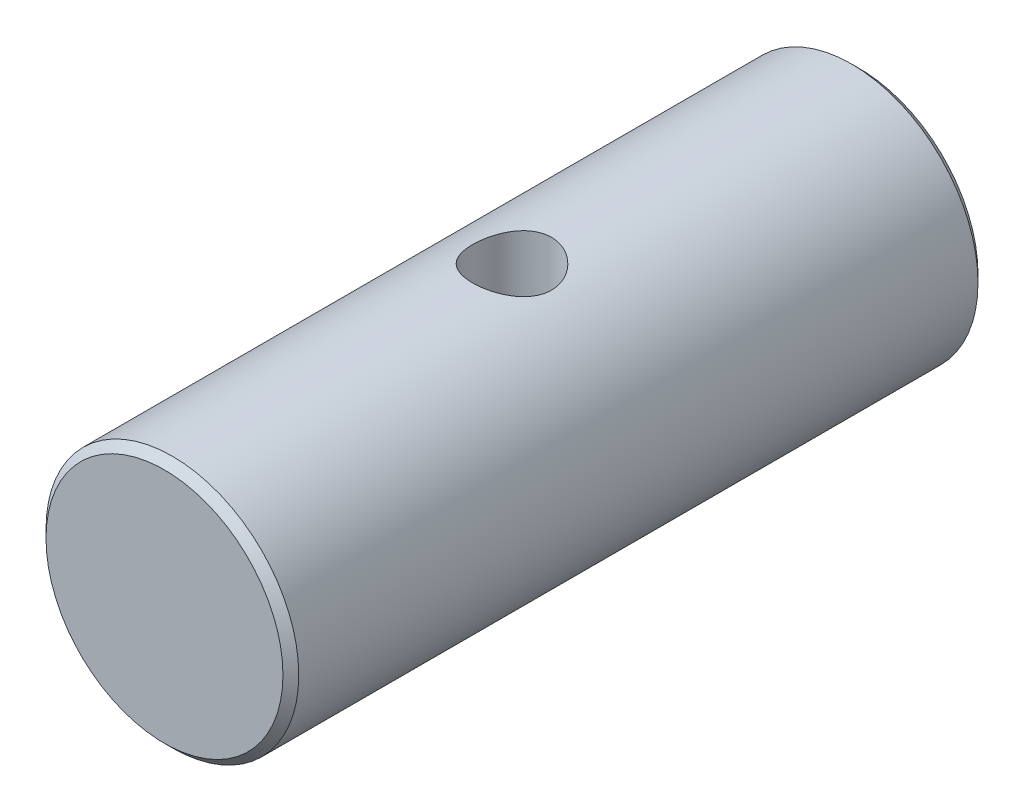
ISO-10303-21;
HEADER;
FILE_DESCRIPTION(('STEP AP214'),'2;1');
FILE_NAME('part.step','',(''),(''),'','','');
FILE_SCHEMA(('AUTOMOTIVE_DESIGN { 1 0 10303 214 1 1 1 1 }'));
ENDSEC;
DATA;
#1=APPLICATION_CONTEXT('core data for automotive mechanical design processes');
#2=APPLICATION_PROTOCOL_DEFINITION('international standard','automotive_design',2000,#1);
#3=PRODUCT_CONTEXT('',#1,'mechanical');
#4=PRODUCT('Part','Part','',(#3));
#5=PRODUCT_RELATED_PRODUCT_CATEGORY('part','',(#4));
#6=PRODUCT_DEFINITION_FORMATION('','',#4);
#7=PRODUCT_DEFINITION_CONTEXT('part definition',#1,'design');
#8=PRODUCT_DEFINITION('design','',#6,#7);
#9=PRODUCT_DEFINITION_SHAPE('','',#8);
#10=(LENGTH_UNIT() NAMED_UNIT(*) SI_UNIT(.MILLI.,.METRE.));
#11=(NAMED_UNIT(*) PLANE_ANGLE_UNIT() SI_UNIT($,.RADIAN.));
#12=(NAMED_UNIT(*) SI_UNIT($,.STERADIAN.) SOLID_ANGLE_UNIT());
#13=UNCERTAINTY_MEASURE_WITH_UNIT(LENGTH_MEASURE(1.E-05),#10,'distance_accuracy_value','');
#14=(GEOMETRIC_REPRESENTATION_CONTEXT(3) GLOBAL_UNCERTAINTY_ASSIGNED_CONTEXT((#13)) GLOBAL_UNIT_ASSIGNED_CONTEXT((#10,
#11,#12)) REPRESENTATION_CONTEXT('',''));
#15=CARTESIAN_POINT('',(0.,0.,0.));
#16=DIRECTION('',(0.,0.,1.));
#17=DIRECTION('',(1.,0.,0.));
#18=AXIS2_PLACEMENT_3D('',#15,#16,#17);
#19=CARTESIAN_POINT('',(0.,0.,44.));
#20=DIRECTION('',(0.,0.,-1.));
#21=DIRECTION('',(-1.,0.,0.));
#22=AXIS2_PLACEMENT_3D('',#19,#20,#21);
#23=CYLINDRICAL_SURFACE('',#22,8.);
#24=CARTESIAN_POINT('',(0.,0.,0.5));
#25=DIRECTION('',(0.,0.,1.));
#26=DIRECTION('',(1.,0.,0.));
#27=AXIS2_PLACEMENT_3D('',#24,#25,#26);
#28=CIRCLE('',#27,8.);
#29=CARTESIAN_POINT('',(8.,0.,0.5));
#30=VERTEX_POINT('',#29);
#31=EDGE_CURVE('E48',#30,#30,#28,.T.);
#32=ORIENTED_EDGE('',*,*,#31,.T.);
#33=EDGE_LOOP('',(#32));
#34=FACE_BOUND('',#33,.T.);
#35=CARTESIAN_POINT('',(0.,0.,43.5));
#36=DIRECTION('',(0.,0.,1.));
#37=DIRECTION('',(1.,0.,0.));
#38=AXIS2_PLACEMENT_3D('',#35,#36,#37);
#39=CIRCLE('',#38,8.);
#40=CARTESIAN_POINT('',(8.,0.,43.5));
#41=VERTEX_POINT('',#40);
#42=EDGE_CURVE('E52',#41,#41,#39,.F.);
#43=ORIENTED_EDGE('',*,*,#42,.T.);
#44=EDGE_LOOP('',(#43));
#45=FACE_BOUND('',#44,.T.);
#46=CARTESIAN_POINT('',(0.,-8.,24.5));
#47=CARTESIAN_POINT('',(0.136878370349093,-7.9999993175598,24.4999991068248));
#48=CARTESIAN_POINT('',(0.273766105005718,-7.99645389969682,24.4887215461111));
#49=CARTESIAN_POINT('',(0.543538419176896,-7.98265788177613,24.4440275169215));
#50=CARTESIAN_POINT('',(0.676422085451815,-7.97240576399719,24.4106060372713));
#51=CARTESIAN_POINT('',(0.934257087301613,-7.94631631395819,24.3228612576085));
#52=CARTESIAN_POINT('',(1.05922035397161,-7.9304876299805,24.2685703106941));
#53=CARTESIAN_POINT('',(1.29826960469292,-7.89487938322185,24.1407653646433));
#54=CARTESIAN_POINT('',(1.41235387088977,-7.8750991979981,24.0672483364388));
#55=CARTESIAN_POINT('',(1.62993066990456,-7.83300427480565,23.9006880159653));
#56=CARTESIAN_POINT('',(1.73304005631332,-7.81063431853978,23.8071582298779));
#57=CARTESIAN_POINT('',(1.92239476407399,-7.76620092748417,23.6042632151729));
#58=CARTESIAN_POINT('',(2.00863694579739,-7.74413755046914,23.4948950450109));
#59=CARTESIAN_POINT('',(2.16388672966227,-7.70222289396344,23.2601108723838));
#60=CARTESIAN_POINT('',(2.23241568300257,-7.68243976603591,23.1343650449456));
#61=CARTESIAN_POINT('',(2.34719482153343,-7.64815603598468,22.8724153700363));
#62=CARTESIAN_POINT('',(2.39345087543889,-7.63365404257377,22.7362142884121));
#63=CARTESIAN_POINT('',(2.46096919860067,-7.61215213969001,22.4615438450959));
#64=CARTESIAN_POINT('',(2.48294220015729,-7.60493945859016,22.3232663127223));
#65=CARTESIAN_POINT('',(2.50349110073976,-7.59820110281901,22.0448137621762));
#66=CARTESIAN_POINT('',(2.50207321991544,-7.59867338454669,21.9046392583567));
#67=CARTESIAN_POINT('',(2.47643649465478,-7.60706378150876,21.632251079462));
#68=CARTESIAN_POINT('',(2.45312115738766,-7.61468683491897,21.4999417482769));
#69=CARTESIAN_POINT('',(2.38581626711252,-7.63604051304978,21.2412156869253));
#70=CARTESIAN_POINT('',(2.34182451689101,-7.64977178686229,21.1147995845824));
#71=CARTESIAN_POINT('',(2.23377749362555,-7.68202088028593,20.8692961111347));
#72=CARTESIAN_POINT('',(2.16943851324164,-7.70060569321649,20.750342778616));
#73=CARTESIAN_POINT('',(2.02272041475696,-7.7404371316014,20.5246244642418));
#74=CARTESIAN_POINT('',(1.94033661043155,-7.76168444789102,20.4178626594926));
#75=CARTESIAN_POINT('',(1.75543390836425,-7.80563055600986,20.214450113166));
#76=CARTESIAN_POINT('',(1.65216914118564,-7.82835139211391,20.1184808844406));
#77=CARTESIAN_POINT('',(1.43072881619106,-7.8718314151916,19.9450562128406));
#78=CARTESIAN_POINT('',(1.31255215469804,-7.89259045676745,19.8676021415616));
#79=CARTESIAN_POINT('',(1.06332922093091,-7.93002589780382,19.7329446227974));
#80=CARTESIAN_POINT('',(0.932189813838559,-7.94666921296415,19.6759037290721));
#81=CARTESIAN_POINT('',(0.661535955565289,-7.97375911657108,19.5848939982969));
#82=CARTESIAN_POINT('',(0.522024061449218,-7.98420758650304,19.5509181555232));
#83=CARTESIAN_POINT('',(0.244370314580691,-7.99742778790027,19.508163914842));
#84=CARTESIAN_POINT('',(0.106383697577687,-8.00048045790873,19.4984629128129));
#85=CARTESIAN_POINT('',(-0.169260611465171,-7.99939599461967,19.5019324532747));
#86=CARTESIAN_POINT('',(-0.306918348613017,-7.9952599116227,19.5150996546452));
#87=CARTESIAN_POINT('',(-0.574438665951697,-7.98044727539523,19.5631911852128));
#88=CARTESIAN_POINT('',(-0.704409956841872,-7.96993586221374,19.597566535225));
#89=CARTESIAN_POINT('',(-0.956703857722753,-7.94360242758579,19.6864287047334));
#90=CARTESIAN_POINT('',(-1.07902552089812,-7.92777975028687,19.74091800805));
#91=CARTESIAN_POINT('',(-1.31586481334438,-7.89197085518848,19.8699464330974));
#92=CARTESIAN_POINT('',(-1.43011947957558,-7.87189253635335,19.9449419749936));
#93=CARTESIAN_POINT('',(-1.64473170192052,-7.82986820006859,20.1123064202349));
#94=CARTESIAN_POINT('',(-1.7450854760879,-7.80792167695774,20.2046800354893));
#95=CARTESIAN_POINT('',(-1.93317492583804,-7.76353989766283,20.4085177801042));
#96=CARTESIAN_POINT('',(-2.02025304679062,-7.74111973412883,20.5205933274784));
#97=CARTESIAN_POINT('',(-2.17442500490303,-7.69923894191212,20.7582532327535));
#98=CARTESIAN_POINT('',(-2.24151915946859,-7.67977826622621,20.883837376054));
#99=CARTESIAN_POINT('',(-2.35340166961084,-7.64623564661738,21.144690345741));
#100=CARTESIAN_POINT('',(-2.39827639112025,-7.63213292713749,21.2799192988714));
#101=CARTESIAN_POINT('',(-2.4644578863618,-7.6110234168862,21.5565449864972));
#102=CARTESIAN_POINT('',(-2.48577362827989,-7.60401392602456,21.6979393526871));
#103=CARTESIAN_POINT('',(-2.50358812316251,-7.59816585427753,21.9760081751609));
#104=CARTESIAN_POINT('',(-2.50116559243271,-7.59897209200284,22.1126069076948));
#105=CARTESIAN_POINT('',(-2.47417636257668,-7.60780180751807,22.3833491698839));
#106=CARTESIAN_POINT('',(-2.44961069645024,-7.61582494863208,22.5174928137735));
#107=CARTESIAN_POINT('',(-2.37975459827235,-7.6379362836678,22.7775880791838));
#108=CARTESIAN_POINT('',(-2.33477284812017,-7.65193396380514,22.9036308821867));
#109=CARTESIAN_POINT('',(-2.22560454669999,-7.68439408509128,23.146480827068));
#110=CARTESIAN_POINT('',(-2.16141408888474,-7.70285743429343,23.2632860841568));
#111=CARTESIAN_POINT('',(-2.01271350026987,-7.74306974067005,23.4892919408796));
#112=CARTESIAN_POINT('',(-1.92750667048265,-7.76491897845913,23.5980162590005));
#113=CARTESIAN_POINT('',(-1.7404179928096,-7.8089799764242,23.799972656224));
#114=CARTESIAN_POINT('',(-1.63853168468878,-7.83119183213309,23.8932005779821));
#115=CARTESIAN_POINT('',(-1.41697332564669,-7.87434543904947,24.0645650767259));
#116=CARTESIAN_POINT('',(-1.29682914897477,-7.89522203461346,24.1421094728999));
#117=CARTESIAN_POINT('',(-1.0445582760273,-7.93253538593756,24.2757978302789));
#118=CARTESIAN_POINT('',(-0.912436315590897,-7.94897388631644,24.3319502042837));
#119=CARTESIAN_POINT('',(-0.651495270747958,-7.97441301466941,24.4171827352169));
#120=CARTESIAN_POINT('',(-0.523340674225093,-7.98392481612283,24.4481497346107));
#121=CARTESIAN_POINT('',(-0.263459790880495,-7.99671800680967,24.4895567199354));
#122=CARTESIAN_POINT('',(-0.13173423227935,-8.00000065679286,24.500000859608));
#123=CARTESIAN_POINT('',(0.,-8.,24.5));
#124=B_SPLINE_CURVE_WITH_KNOTS('',3,(#46,#47,#48,#49,#50,#51,#52,#53,#54,#55,#56,#57,#58,#59,
#60,#61,#62,#63,#64,#65,#66,#67,#68,#69,#70,#71,#72,#73,#74,#75,#76,#77,#78,#79,#80,#81,#82,#83,
#84,#85,#86,#87,#88,#89,#90,#91,#92,#93,#94,#95,#96,#97,#98,#99,#100,#101,#102,#103,#104,#105,
#106,#107,#108,#109,#110,#111,#112,#113,#114,#115,#116,#117,#118,#119,#120,#121,#122,#123),
.UNSPECIFIED.,.T.,.F.,(4,2,2,2,2,2,2,2,2,2,2,2,2,2,2,2,2,2,2,2,2,2,2,2,2,2,2,2,2,2,2,2,2,2,2,2,
2,2,4),(0.,0.41015089886502,0.820394646698132,1.23000495840487,1.63967984311678,
2.06075644390316,2.48191134862552,2.91347542494988,3.34492572559054,3.76338300334419,
4.18172900590276,4.58353834844338,4.98539039958125,5.3931128544109,5.80094132020716,
6.227334945592,6.65376014826606,7.0835092137954,7.51312768989108,7.92615137096475,
8.33911471298725,8.74181253445744,9.14456010068999,9.55712649476687,9.96980491418518,
10.3988355742628,10.8278594196742,11.2552023150671,11.6823824779468,12.0902440696666,
12.4980866352126,12.8999582681244,13.3019116867944,13.7195902803182,14.1373807476578,
14.5688133627192,15.0000761335177,15.3948927332218,15.7896294154519),.UNSPECIFIED.);
#125=CARTESIAN_POINT('',(0.,-8.,24.5));
#126=VERTEX_POINT('',#125);
#127=EDGE_CURVE('E57',#126,#126,#124,.T.);
#128=ORIENTED_EDGE('',*,*,#127,.T.);
#129=EDGE_LOOP('',(#128));
#130=FACE_BOUND('',#129,.T.);
#131=CARTESIAN_POINT('',(0.,8.,24.5));
#132=CARTESIAN_POINT('',(-0.136878370349093,7.9999993175598,24.4999991068248));
#133=CARTESIAN_POINT('',(-0.273766105005718,7.99645389969682,24.4887215461111));
#134=CARTESIAN_POINT('',(-0.543538419176896,7.98265788177613,24.4440275169215));
#135=CARTESIAN_POINT('',(-0.676422085451815,7.97240576399719,24.4106060372713));
#136=CARTESIAN_POINT('',(-0.934257087301613,7.94631631395819,24.3228612576085));
#137=CARTESIAN_POINT('',(-1.05922035397161,7.9304876299805,24.2685703106941));
#138=CARTESIAN_POINT('',(-1.29826960469292,7.89487938322185,24.1407653646433));
#139=CARTESIAN_POINT('',(-1.41235387088977,7.8750991979981,24.0672483364388));
#140=CARTESIAN_POINT('',(-1.62993066990456,7.83300427480565,23.9006880159653));
#141=CARTESIAN_POINT('',(-1.73304005631332,7.81063431853978,23.8071582298779));
#142=CARTESIAN_POINT('',(-1.92239476407399,7.76620092748417,23.6042632151729));
#143=CARTESIAN_POINT('',(-2.00863694579739,7.74413755046914,23.4948950450109));
#144=CARTESIAN_POINT('',(-2.16388672966227,7.70222289396344,23.2601108723838));
#145=CARTESIAN_POINT('',(-2.23241568300257,7.68243976603591,23.1343650449456));
#146=CARTESIAN_POINT('',(-2.34719482153343,7.64815603598468,22.8724153700363));
#147=CARTESIAN_POINT('',(-2.39345087543889,7.63365404257377,22.7362142884121));
#148=CARTESIAN_POINT('',(-2.46096919860067,7.61215213969001,22.4615438450959));
#149=CARTESIAN_POINT('',(-2.48294220015729,7.60493945859016,22.3232663127223));
#150=CARTESIAN_POINT('',(-2.50349110073976,7.59820110281901,22.0448137621762));
#151=CARTESIAN_POINT('',(-2.50207321991544,7.59867338454669,21.9046392583567));
#152=CARTESIAN_POINT('',(-2.47643649465478,7.60706378150876,21.632251079462));
#153=CARTESIAN_POINT('',(-2.45312115738766,7.61468683491897,21.4999417482769));
#154=CARTESIAN_POINT('',(-2.38581626711252,7.63604051304978,21.2412156869253));
#155=CARTESIAN_POINT('',(-2.34182451689101,7.64977178686229,21.1147995845824));
#156=CARTESIAN_POINT('',(-2.23377749362555,7.68202088028593,20.8692961111347));
#157=CARTESIAN_POINT('',(-2.16943851324164,7.70060569321649,20.750342778616));
#158=CARTESIAN_POINT('',(-2.02272041475696,7.7404371316014,20.5246244642418));
#159=CARTESIAN_POINT('',(-1.94033661043155,7.76168444789102,20.4178626594926));
#160=CARTESIAN_POINT('',(-1.75543390836425,7.80563055600986,20.214450113166));
#161=CARTESIAN_POINT('',(-1.65216914118564,7.82835139211391,20.1184808844406));
#162=CARTESIAN_POINT('',(-1.43072881619106,7.8718314151916,19.9450562128406));
#163=CARTESIAN_POINT('',(-1.31255215469804,7.89259045676745,19.8676021415616));
#164=CARTESIAN_POINT('',(-1.06332922093091,7.93002589780382,19.7329446227974));
#165=CARTESIAN_POINT('',(-0.932189813838559,7.94666921296415,19.6759037290721));
#166=CARTESIAN_POINT('',(-0.661535955565289,7.97375911657108,19.5848939982969));
#167=CARTESIAN_POINT('',(-0.522024061449218,7.98420758650304,19.5509181555232));
#168=CARTESIAN_POINT('',(-0.244370314580691,7.99742778790027,19.508163914842));
#169=CARTESIAN_POINT('',(-0.106383697577687,8.00048045790873,19.4984629128129));
#170=CARTESIAN_POINT('',(0.169260611465171,7.99939599461967,19.5019324532747));
#171=CARTESIAN_POINT('',(0.306918348613017,7.9952599116227,19.5150996546452));
#172=CARTESIAN_POINT('',(0.574438665951697,7.98044727539523,19.5631911852128));
#173=CARTESIAN_POINT('',(0.704409956841872,7.96993586221374,19.597566535225));
#174=CARTESIAN_POINT('',(0.956703857722753,7.94360242758579,19.6864287047334));
#175=CARTESIAN_POINT('',(1.07902552089812,7.92777975028687,19.74091800805));
#176=CARTESIAN_POINT('',(1.31586481334438,7.89197085518848,19.8699464330974));
#177=CARTESIAN_POINT('',(1.43011947957558,7.87189253635335,19.9449419749936));
#178=CARTESIAN_POINT('',(1.64473170192052,7.82986820006859,20.1123064202349));
#179=CARTESIAN_POINT('',(1.7450854760879,7.80792167695774,20.2046800354893));
#180=CARTESIAN_POINT('',(1.93317492583804,7.76353989766283,20.4085177801042));
#181=CARTESIAN_POINT('',(2.02025304679062,7.74111973412883,20.5205933274784));
#182=CARTESIAN_POINT('',(2.17442500490303,7.69923894191212,20.7582532327535));
#183=CARTESIAN_POINT('',(2.24151915946859,7.67977826622621,20.883837376054));
#184=CARTESIAN_POINT('',(2.35340166961084,7.64623564661738,21.144690345741));
#185=CARTESIAN_POINT('',(2.39827639112025,7.63213292713749,21.2799192988714));
#186=CARTESIAN_POINT('',(2.4644578863618,7.6110234168862,21.5565449864972));
#187=CARTESIAN_POINT('',(2.48577362827989,7.60401392602456,21.6979393526871));
#188=CARTESIAN_POINT('',(2.50358812316251,7.59816585427753,21.9760081751609));
#189=CARTESIAN_POINT('',(2.50116559243271,7.59897209200284,22.1126069076948));
#190=CARTESIAN_POINT('',(2.47417636257668,7.60780180751807,22.3833491698839));
#191=CARTESIAN_POINT('',(2.44961069645024,7.61582494863208,22.5174928137735));
#192=CARTESIAN_POINT('',(2.37975459827235,7.6379362836678,22.7775880791838));
#193=CARTESIAN_POINT('',(2.33477284812017,7.65193396380514,22.9036308821867));
#194=CARTESIAN_POINT('',(2.22560454669999,7.68439408509128,23.146480827068));
#195=CARTESIAN_POINT('',(2.16141408888474,7.70285743429343,23.2632860841568));
#196=CARTESIAN_POINT('',(2.01271350026987,7.74306974067005,23.4892919408796));
#197=CARTESIAN_POINT('',(1.92750667048265,7.76491897845913,23.5980162590005));
#198=CARTESIAN_POINT('',(1.7404179928096,7.8089799764242,23.799972656224));
#199=CARTESIAN_POINT('',(1.63853168468878,7.83119183213309,23.8932005779821));
#200=CARTESIAN_POINT('',(1.41697332564669,7.87434543904947,24.0645650767259));
#201=CARTESIAN_POINT('',(1.29682914897477,7.89522203461346,24.1421094728999));
#202=CARTESIAN_POINT('',(1.0445582760273,7.93253538593756,24.2757978302789));
#203=CARTESIAN_POINT('',(0.912436315590897,7.94897388631644,24.3319502042837));
#204=CARTESIAN_POINT('',(0.651495270747958,7.97441301466941,24.4171827352169));
#205=CARTESIAN_POINT('',(0.523340674225093,7.98392481612283,24.4481497346107));
#206=CARTESIAN_POINT('',(0.263459790880495,7.99671800680967,24.4895567199354));
#207=CARTESIAN_POINT('',(0.13173423227935,8.00000065679286,24.500000859608));
#208=CARTESIAN_POINT('',(0.,8.,24.5));
#209=B_SPLINE_CURVE_WITH_KNOTS('',3,(#131,#132,#133,#134,#135,#136,#137,#138,#139,#140,#141,
#142,#143,#144,#145,#146,#147,#148,#149,#150,#151,#152,#153,#154,#155,#156,#157,#158,#159,#160,
#161,#162,#163,#164,#165,#166,#167,#168,#169,#170,#171,#172,#173,#174,#175,#176,#177,#178,#179,
#180,#181,#182,#183,#184,#185,#186,#187,#188,#189,#190,#191,#192,#193,#194,#195,#196,#197,#198,
#199,#200,#201,#202,#203,#204,#205,#206,#207,#208),.UNSPECIFIED.,.T.,.F.,(4,2,2,2,2,2,2,2,2,2,2,
2,2,2,2,2,2,2,2,2,2,2,2,2,2,2,2,2,2,2,2,2,2,2,2,2,2,2,4),(0.,0.41015089886502,0.820394646698132,
1.23000495840487,1.63967984311678,2.06075644390316,2.48191134862552,2.91347542494988,
3.34492572559054,3.76338300334419,4.18172900590276,4.58353834844338,4.98539039958125,
5.3931128544109,5.80094132020716,6.227334945592,6.65376014826606,7.0835092137954,
7.51312768989108,7.92615137096475,8.33911471298725,8.74181253445744,9.14456010068999,
9.55712649476687,9.96980491418518,10.3988355742628,10.8278594196742,11.2552023150671,
11.6823824779468,12.0902440696666,12.4980866352126,12.8999582681244,13.3019116867944,
13.7195902803182,14.1373807476578,14.5688133627192,15.0000761335177,15.3948927332218,
15.7896294154519),.UNSPECIFIED.);
#210=CARTESIAN_POINT('',(0.,8.,24.5));
#211=VERTEX_POINT('',#210);
#212=EDGE_CURVE('E65',#211,#211,#209,.T.);
#213=ORIENTED_EDGE('',*,*,#212,.T.);
#214=EDGE_LOOP('',(#213));
#215=FACE_BOUND('',#214,.T.);
#216=ADVANCED_FACE('F36',(#34,#45,#130,#215),#23,.T.);
#217=CARTESIAN_POINT('',(0.,0.,44.));
#218=DIRECTION('',(0.,0.,1.));
#219=DIRECTION('',(1.,0.,0.));
#220=AXIS2_PLACEMENT_3D('',#217,#218,#219);
#221=PLANE('',#220);
#222=CARTESIAN_POINT('',(0.,0.,44.));
#223=DIRECTION('',(0.,0.,1.));
#224=DIRECTION('',(1.,0.,0.));
#225=AXIS2_PLACEMENT_3D('',#222,#223,#224);
#226=CIRCLE('',#225,7.5);
#227=CARTESIAN_POINT('',(7.5,0.,44.));
#228=VERTEX_POINT('',#227);
#229=EDGE_CURVE('E10',#228,#228,#226,.T.);
#230=ORIENTED_EDGE('',*,*,#229,.T.);
#231=EDGE_LOOP('',(#230));
#232=FACE_BOUND('',#231,.T.);
#233=ADVANCED_FACE('F78',(#232),#221,.T.);
#234=CARTESIAN_POINT('',(0.,0.,0.));
#235=DIRECTION('',(0.,0.,1.));
#236=DIRECTION('',(1.,0.,0.));
#237=AXIS2_PLACEMENT_3D('',#234,#235,#236);
#238=PLANE('',#237);
#239=CARTESIAN_POINT('',(0.,0.,0.));
#240=DIRECTION('',(0.,0.,1.));
#241=DIRECTION('',(1.,0.,0.));
#242=AXIS2_PLACEMENT_3D('',#239,#240,#241);
#243=CIRCLE('',#242,7.49999999999999);
#244=CARTESIAN_POINT('',(7.49999999999999,0.,0.));
#245=VERTEX_POINT('',#244);
#246=EDGE_CURVE('E44',#245,#245,#243,.F.);
#247=ORIENTED_EDGE('',*,*,#246,.T.);
#248=EDGE_LOOP('',(#247));
#249=FACE_BOUND('',#248,.T.);
#250=ADVANCED_FACE('F76',(#249),#238,.F.);
#251=CARTESIAN_POINT('',(0.,-8.,22.));
#252=DIRECTION('',(0.,1.,0.));
#253=DIRECTION('',(0.,0.,1.));
#254=AXIS2_PLACEMENT_3D('',#251,#252,#253);
#255=CYLINDRICAL_SURFACE('',#254,2.5);
#256=ORIENTED_EDGE('',*,*,#212,.F.);
#257=EDGE_LOOP('',(#256));
#258=FACE_BOUND('',#257,.T.);
#259=ORIENTED_EDGE('',*,*,#127,.F.);
#260=EDGE_LOOP('',(#259));
#261=FACE_BOUND('',#260,.T.);
#262=ADVANCED_FACE('F71',(#258,#261),#255,.F.);
#263=CARTESIAN_POINT('',(0.,0.,0.5));
#264=DIRECTION('',(0.,0.,1.));
#265=DIRECTION('',(1.,0.,0.));
#266=AXIS2_PLACEMENT_3D('',#263,#264,#265);
#267=CONICAL_SURFACE('',#266,8.,0.785398163397455);
#268=ORIENTED_EDGE('',*,*,#246,.F.);
#269=EDGE_LOOP('',(#268));
#270=FACE_BOUND('',#269,.T.);
#271=ORIENTED_EDGE('',*,*,#31,.F.);
#272=EDGE_LOOP('',(#271));
#273=FACE_BOUND('',#272,.T.);
#274=ADVANCED_FACE('F75',(#270,#273),#267,.T.);
#275=CARTESIAN_POINT('',(0.,0.,44.));
#276=DIRECTION('',(0.,0.,-1.));
#277=DIRECTION('',(-1.,0.,0.));
#278=AXIS2_PLACEMENT_3D('',#275,#276,#277);
#279=CONICAL_SURFACE('',#278,7.5,0.785398163397448);
#280=ORIENTED_EDGE('',*,*,#42,.F.);
#281=EDGE_LOOP('',(#280));
#282=FACE_BOUND('',#281,.T.);
#283=ORIENTED_EDGE('',*,*,#229,.F.);
#284=EDGE_LOOP('',(#283));
#285=FACE_BOUND('',#284,.T.);
#286=ADVANCED_FACE('F39',(#282,#285),#279,.T.);
#287=CLOSED_SHELL('',(#216,#233,#250,#262,#274,#286));
#288=MANIFOLD_SOLID_BREP('B2',#287);
#289=ADVANCED_BREP_SHAPE_REPRESENTATION('',(#18,#288),#14);
#290=SHAPE_DEFINITION_REPRESENTATION(#9,#289);
ENDSEC;
END-ISO-10303-21;
